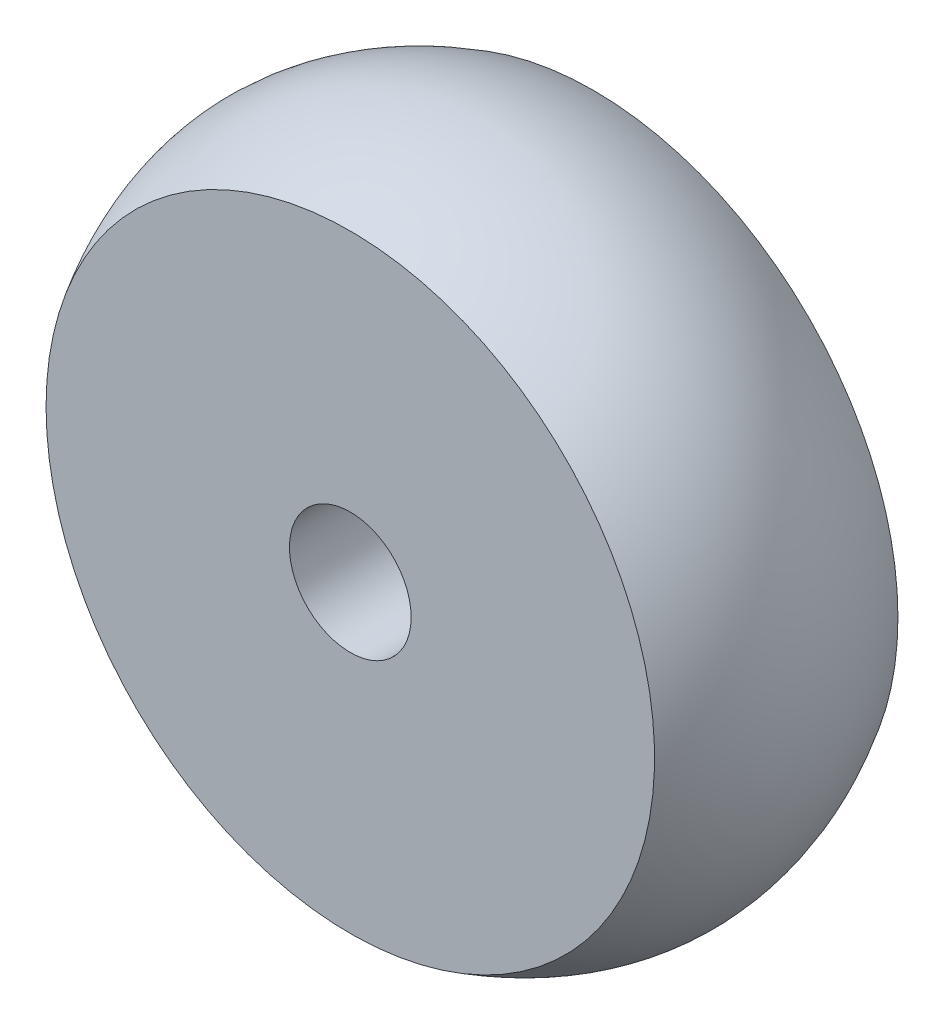
ISO-10303-21;
HEADER;
FILE_DESCRIPTION(('STEP AP214'),'2;1');
FILE_NAME('part.step','',(''),(''),'','','');
FILE_SCHEMA(('AUTOMOTIVE_DESIGN { 1 0 10303 214 1 1 1 1 }'));
ENDSEC;
DATA;
#1=APPLICATION_CONTEXT('core data for automotive mechanical design processes');
#2=APPLICATION_PROTOCOL_DEFINITION('international standard','automotive_design',2000,#1);
#3=PRODUCT_CONTEXT('',#1,'mechanical');
#4=PRODUCT('Part','Part','',(#3));
#5=PRODUCT_RELATED_PRODUCT_CATEGORY('part','',(#4));
#6=PRODUCT_DEFINITION_FORMATION('','',#4);
#7=PRODUCT_DEFINITION_CONTEXT('part definition',#1,'design');
#8=PRODUCT_DEFINITION('design','',#6,#7);
#9=PRODUCT_DEFINITION_SHAPE('','',#8);
#10=(LENGTH_UNIT() NAMED_UNIT(*) SI_UNIT(.MILLI.,.METRE.));
#11=(NAMED_UNIT(*) PLANE_ANGLE_UNIT() SI_UNIT($,.RADIAN.));
#12=(NAMED_UNIT(*) SI_UNIT($,.STERADIAN.) SOLID_ANGLE_UNIT());
#13=UNCERTAINTY_MEASURE_WITH_UNIT(LENGTH_MEASURE(1.E-05),#10,'distance_accuracy_value','');
#14=(GEOMETRIC_REPRESENTATION_CONTEXT(3) GLOBAL_UNCERTAINTY_ASSIGNED_CONTEXT((#13)) GLOBAL_UNIT_ASSIGNED_CONTEXT((#10,
#11,#12)) REPRESENTATION_CONTEXT('',''));
#15=CARTESIAN_POINT('',(0.,0.,0.));
#16=DIRECTION('',(0.,0.,1.));
#17=DIRECTION('',(1.,0.,0.));
#18=AXIS2_PLACEMENT_3D('',#15,#16,#17);
#19=CARTESIAN_POINT('',(0.,0.,10.));
#20=DIRECTION('',(0.,0.,1.));
#21=DIRECTION('',(1.,0.,0.));
#22=AXIS2_PLACEMENT_3D('',#19,#20,#21);
#23=PLANE('',#22);
#24=CARTESIAN_POINT('',(0.,0.,10.));
#25=DIRECTION('',(0.,0.,-1.));
#26=DIRECTION('',(-1.,0.,0.));
#27=AXIS2_PLACEMENT_3D('',#24,#25,#26);
#28=CIRCLE('',#27,12.5);
#29=CARTESIAN_POINT('',(-12.5,0.,10.));
#30=VERTEX_POINT('',#29);
#31=EDGE_CURVE('E49',#30,#30,#28,.T.);
#32=ORIENTED_EDGE('',*,*,#31,.F.);
#33=EDGE_LOOP('',(#32));
#34=FACE_BOUND('',#33,.T.);
#35=CARTESIAN_POINT('',(0.,0.,10.));
#36=DIRECTION('',(0.,0.,1.));
#37=DIRECTION('',(1.,0.,0.));
#38=AXIS2_PLACEMENT_3D('',#35,#36,#37);
#39=CIRCLE('',#38,2.5);
#40=CARTESIAN_POINT('',(2.5,0.,10.));
#41=VERTEX_POINT('',#40);
#42=EDGE_CURVE('E40',#41,#41,#39,.T.);
#43=ORIENTED_EDGE('',*,*,#42,.F.);
#44=EDGE_LOOP('',(#43));
#45=FACE_BOUND('',#44,.T.);
#46=ADVANCED_FACE('F33',(#34,#45),#23,.T.);
#47=CARTESIAN_POINT('',(0.,0.,0.));
#48=DIRECTION('',(0.,0.,1.));
#49=DIRECTION('',(1.,0.,0.));
#50=AXIS2_PLACEMENT_3D('',#47,#48,#49);
#51=PLANE('',#50);
#52=CARTESIAN_POINT('',(0.,0.,0.));
#53=DIRECTION('',(0.,0.,1.));
#54=DIRECTION('',(1.,0.,0.));
#55=AXIS2_PLACEMENT_3D('',#52,#53,#54);
#56=CIRCLE('',#55,12.5);
#57=CARTESIAN_POINT('',(12.5,0.,0.));
#58=VERTEX_POINT('',#57);
#59=EDGE_CURVE('E10',#58,#58,#56,.T.);
#60=ORIENTED_EDGE('',*,*,#59,.F.);
#61=EDGE_LOOP('',(#60));
#62=FACE_BOUND('',#61,.T.);
#63=CARTESIAN_POINT('',(0.,0.,0.));
#64=DIRECTION('',(0.,0.,1.));
#65=DIRECTION('',(1.,0.,0.));
#66=AXIS2_PLACEMENT_3D('',#63,#64,#65);
#67=CIRCLE('',#66,2.5);
#68=CARTESIAN_POINT('',(2.5,0.,0.));
#69=VERTEX_POINT('',#68);
#70=EDGE_CURVE('E44',#69,#69,#67,.T.);
#71=ORIENTED_EDGE('',*,*,#70,.T.);
#72=EDGE_LOOP('',(#71));
#73=FACE_BOUND('',#72,.T.);
#74=ADVANCED_FACE('F35',(#62,#73),#51,.F.);
#75=CARTESIAN_POINT('',(0.,0.,10.));
#76=DIRECTION('',(0.,0.,-1.));
#77=DIRECTION('',(-1.,0.,0.));
#78=AXIS2_PLACEMENT_3D('',#75,#76,#77);
#79=CYLINDRICAL_SURFACE('',#78,2.5);
#80=ORIENTED_EDGE('',*,*,#42,.T.);
#81=EDGE_LOOP('',(#80));
#82=FACE_BOUND('',#81,.T.);
#83=ORIENTED_EDGE('',*,*,#70,.F.);
#84=EDGE_LOOP('',(#83));
#85=FACE_BOUND('',#84,.T.);
#86=ADVANCED_FACE('F63',(#82,#85),#79,.F.);
#87=CARTESIAN_POINT('',(0.,12.5,0.));
#88=CARTESIAN_POINT('',(0.,15.5,5.));
#89=CARTESIAN_POINT('',(0.,12.5,10.));
#90=B_SPLINE_CURVE_WITH_KNOTS('',2,(#87,#88,#89),.UNSPECIFIED.,.F.,.F.,(3,3),(0.,1.),.UNSPECIFIED.);
#91=CARTESIAN_POINT('',(0.,0.,0.));
#92=DIRECTION('',(0.,0.,-1.));
#93=AXIS1_PLACEMENT('',#91,#92);
#94=SURFACE_OF_REVOLUTION('',#90,#93);
#95=ORIENTED_EDGE('',*,*,#31,.T.);
#96=EDGE_LOOP('',(#95));
#97=FACE_BOUND('',#96,.T.);
#98=ORIENTED_EDGE('',*,*,#59,.T.);
#99=EDGE_LOOP('',(#98));
#100=FACE_BOUND('',#99,.T.);
#101=ADVANCED_FACE('F60',(#97,#100),#94,.F.);
#102=CLOSED_SHELL('',(#46,#74,#86,#101));
#103=MANIFOLD_SOLID_BREP('B2',#102);
#104=ADVANCED_BREP_SHAPE_REPRESENTATION('',(#18,#103),#14);
#105=SHAPE_DEFINITION_REPRESENTATION(#9,#104);
ENDSEC;
END-ISO-10303-21;
